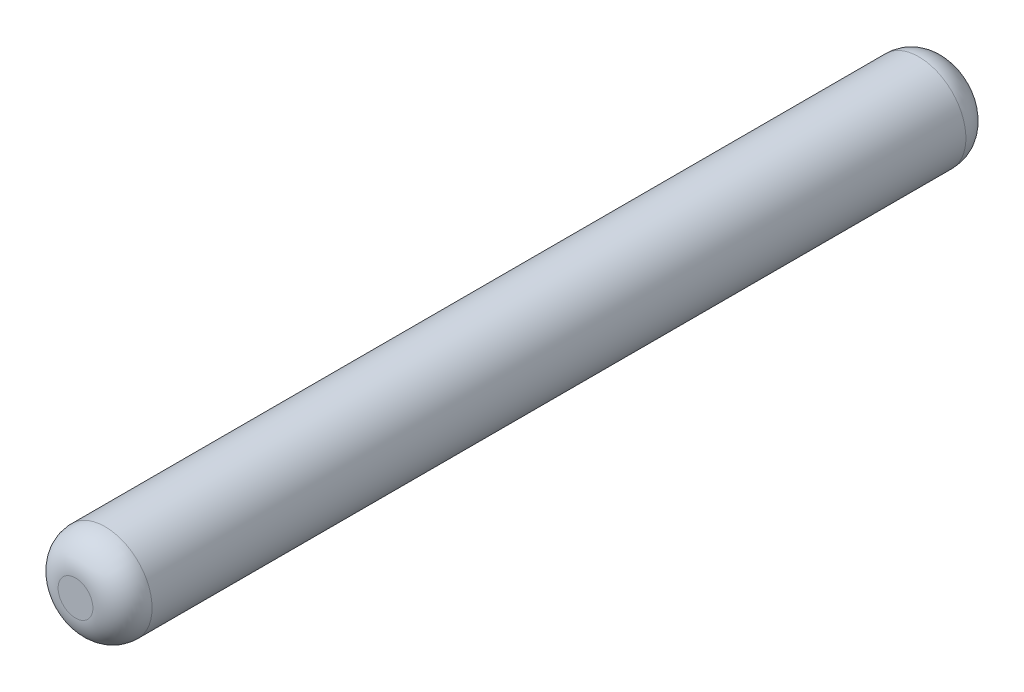
ISO-10303-21;
HEADER;
FILE_DESCRIPTION(('STEP AP214'),'2;1');
FILE_NAME('part.step','',(''),(''),'','','');
FILE_SCHEMA(('AUTOMOTIVE_DESIGN { 1 0 10303 214 1 1 1 1 }'));
ENDSEC;
DATA;
#1=APPLICATION_CONTEXT('core data for automotive mechanical design processes');
#2=APPLICATION_PROTOCOL_DEFINITION('international standard','automotive_design',2000,#1);
#3=PRODUCT_CONTEXT('',#1,'mechanical');
#4=PRODUCT('Part','Part','',(#3));
#5=PRODUCT_RELATED_PRODUCT_CATEGORY('part','',(#4));
#6=PRODUCT_DEFINITION_FORMATION('','',#4);
#7=PRODUCT_DEFINITION_CONTEXT('part definition',#1,'design');
#8=PRODUCT_DEFINITION('design','',#6,#7);
#9=PRODUCT_DEFINITION_SHAPE('','',#8);
#10=(LENGTH_UNIT() NAMED_UNIT(*) SI_UNIT(.MILLI.,.METRE.));
#11=(NAMED_UNIT(*) PLANE_ANGLE_UNIT() SI_UNIT($,.RADIAN.));
#12=(NAMED_UNIT(*) SI_UNIT($,.STERADIAN.) SOLID_ANGLE_UNIT());
#13=UNCERTAINTY_MEASURE_WITH_UNIT(LENGTH_MEASURE(1.E-05),#10,'distance_accuracy_value','');
#14=(GEOMETRIC_REPRESENTATION_CONTEXT(3) GLOBAL_UNCERTAINTY_ASSIGNED_CONTEXT((#13)) GLOBAL_UNIT_ASSIGNED_CONTEXT((#10,
#11,#12)) REPRESENTATION_CONTEXT('',''));
#15=CARTESIAN_POINT('',(0.,0.,0.));
#16=DIRECTION('',(0.,0.,1.));
#17=DIRECTION('',(1.,0.,0.));
#18=AXIS2_PLACEMENT_3D('',#15,#16,#17);
#19=CARTESIAN_POINT('',(0.,0.,0.));
#20=DIRECTION('',(0.,0.,1.));
#21=DIRECTION('',(1.,0.,0.));
#22=AXIS2_PLACEMENT_3D('',#19,#20,#21);
#23=PLANE('',#22);
#24=CARTESIAN_POINT('',(0.,0.,0.));
#25=DIRECTION('',(0.,0.,-1.));
#26=DIRECTION('',(1.,0.,0.));
#27=AXIS2_PLACEMENT_3D('',#24,#25,#26);
#28=CIRCLE('',#27,0.1175);
#29=CARTESIAN_POINT('',(0.1175,0.,0.));
#30=VERTEX_POINT('',#29);
#31=EDGE_CURVE('E10',#30,#30,#28,.T.);
#32=ORIENTED_EDGE('',*,*,#31,.T.);
#33=EDGE_LOOP('',(#32));
#34=FACE_BOUND('',#33,.T.);
#35=ADVANCED_FACE('F15',(#34),#23,.F.);
#36=CARTESIAN_POINT('',(0.,-1.23066263939525E-13,0.20000000000002));
#37=DIRECTION('',(0.,0.,1.));
#38=DIRECTION('',(0.,-1.,0.));
#39=AXIS2_PLACEMENT_3D('',#36,#37,#38);
#40=DEGENERATE_TOROIDAL_SURFACE('',#39,0.117500000000086,0.199999999999981,.T.);
#41=CARTESIAN_POINT('',(0.,0.,0.2));
#42=DIRECTION('',(0.,0.,-1.));
#43=DIRECTION('',(-1.,0.,0.));
#44=AXIS2_PLACEMENT_3D('',#41,#42,#43);
#45=CIRCLE('',#44,0.3175);
#46=CARTESIAN_POINT('',(-0.3175,0.,0.2));
#47=VERTEX_POINT('',#46);
#48=EDGE_CURVE('E23',#47,#47,#45,.T.);
#49=ORIENTED_EDGE('',*,*,#48,.T.);
#50=EDGE_LOOP('',(#49));
#51=FACE_BOUND('',#50,.T.);
#52=ORIENTED_EDGE('',*,*,#31,.F.);
#53=EDGE_LOOP('',(#52));
#54=FACE_BOUND('',#53,.T.);
#55=ADVANCED_FACE('F47',(#51,#54),#40,.T.);
#56=CARTESIAN_POINT('',(0.,0.,0.));
#57=DIRECTION('',(0.,0.,1.));
#58=DIRECTION('',(1.,0.,0.));
#59=AXIS2_PLACEMENT_3D('',#56,#57,#58);
#60=CYLINDRICAL_SURFACE('',#59,0.3175);
#61=CARTESIAN_POINT('',(0.,0.,5.7));
#62=DIRECTION('',(0.,0.,1.));
#63=DIRECTION('',(-1.,0.,0.));
#64=AXIS2_PLACEMENT_3D('',#61,#62,#63);
#65=CIRCLE('',#64,0.3175);
#66=CARTESIAN_POINT('',(-0.3175,0.,5.7));
#67=VERTEX_POINT('',#66);
#68=EDGE_CURVE('E29',#67,#67,#65,.T.);
#69=ORIENTED_EDGE('',*,*,#68,.F.);
#70=EDGE_LOOP('',(#69));
#71=FACE_BOUND('',#70,.T.);
#72=ORIENTED_EDGE('',*,*,#48,.F.);
#73=EDGE_LOOP('',(#72));
#74=FACE_BOUND('',#73,.T.);
#75=ADVANCED_FACE('F39',(#71,#74),#60,.T.);
#76=CARTESIAN_POINT('',(0.,0.,5.69999999999979));
#77=DIRECTION('',(0.,0.,1.));
#78=DIRECTION('',(1.,0.,0.));
#79=AXIS2_PLACEMENT_3D('',#76,#77,#78);
#80=DEGENERATE_TOROIDAL_SURFACE('',#79,0.117499999998528,0.20000000000104,.T.);
#81=ORIENTED_EDGE('',*,*,#68,.T.);
#82=EDGE_LOOP('',(#81));
#83=FACE_BOUND('',#82,.T.);
#84=CARTESIAN_POINT('',(0.,0.,5.9));
#85=DIRECTION('',(0.,0.,1.));
#86=DIRECTION('',(1.,0.,0.));
#87=AXIS2_PLACEMENT_3D('',#84,#85,#86);
#88=CIRCLE('',#87,0.1175);
#89=CARTESIAN_POINT('',(0.1175,0.,5.9));
#90=VERTEX_POINT('',#89);
#91=EDGE_CURVE('E19',#90,#90,#88,.T.);
#92=ORIENTED_EDGE('',*,*,#91,.F.);
#93=EDGE_LOOP('',(#92));
#94=FACE_BOUND('',#93,.T.);
#95=ADVANCED_FACE('F17',(#83,#94),#80,.T.);
#96=CARTESIAN_POINT('',(0.,0.,5.9));
#97=DIRECTION('',(0.,0.,1.));
#98=DIRECTION('',(1.,0.,0.));
#99=AXIS2_PLACEMENT_3D('',#96,#97,#98);
#100=PLANE('',#99);
#101=ORIENTED_EDGE('',*,*,#91,.T.);
#102=EDGE_LOOP('',(#101));
#103=FACE_BOUND('',#102,.T.);
#104=ADVANCED_FACE('F36',(#103),#100,.T.);
#105=CLOSED_SHELL('',(#35,#55,#75,#95,#104));
#106=MANIFOLD_SOLID_BREP('B1',#105);
#107=ADVANCED_BREP_SHAPE_REPRESENTATION('',(#18,#106),#14);
#108=SHAPE_DEFINITION_REPRESENTATION(#9,#107);
ENDSEC;
END-ISO-10303-21;
